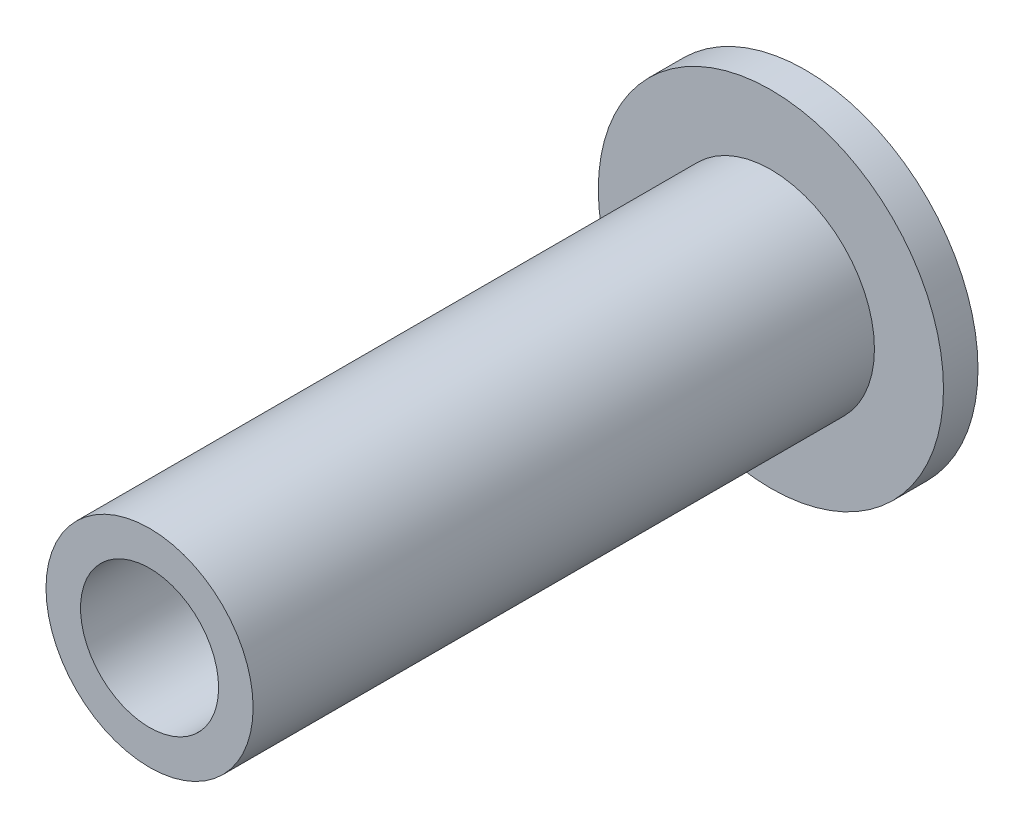
ISO-10303-21;
HEADER;
FILE_DESCRIPTION(('STEP AP214'),'2;1');
FILE_NAME('part.step','',(''),(''),'','','');
FILE_SCHEMA(('AUTOMOTIVE_DESIGN { 1 0 10303 214 1 1 1 1 }'));
ENDSEC;
DATA;
#1=APPLICATION_CONTEXT('core data for automotive mechanical design processes');
#2=APPLICATION_PROTOCOL_DEFINITION('international standard','automotive_design',2000,#1);
#3=PRODUCT_CONTEXT('',#1,'mechanical');
#4=PRODUCT('Part','Part','',(#3));
#5=PRODUCT_RELATED_PRODUCT_CATEGORY('part','',(#4));
#6=PRODUCT_DEFINITION_FORMATION('','',#4);
#7=PRODUCT_DEFINITION_CONTEXT('part definition',#1,'design');
#8=PRODUCT_DEFINITION('design','',#6,#7);
#9=PRODUCT_DEFINITION_SHAPE('','',#8);
#10=(LENGTH_UNIT() NAMED_UNIT(*) SI_UNIT(.MILLI.,.METRE.));
#11=(NAMED_UNIT(*) PLANE_ANGLE_UNIT() SI_UNIT($,.RADIAN.));
#12=(NAMED_UNIT(*) SI_UNIT($,.STERADIAN.) SOLID_ANGLE_UNIT());
#13=UNCERTAINTY_MEASURE_WITH_UNIT(LENGTH_MEASURE(1.E-05),#10,'distance_accuracy_value','');
#14=(GEOMETRIC_REPRESENTATION_CONTEXT(3) GLOBAL_UNCERTAINTY_ASSIGNED_CONTEXT((#13)) GLOBAL_UNIT_ASSIGNED_CONTEXT((#10,
#11,#12)) REPRESENTATION_CONTEXT('',''));
#15=CARTESIAN_POINT('',(0.,0.,0.));
#16=DIRECTION('',(0.,0.,1.));
#17=DIRECTION('',(1.,0.,0.));
#18=AXIS2_PLACEMENT_3D('',#15,#16,#17);
#19=CARTESIAN_POINT('',(0.,3.,18.));
#20=DIRECTION('',(0.,0.,-1.));
#21=DIRECTION('',(-1.,0.,0.));
#22=AXIS2_PLACEMENT_3D('',#19,#20,#21);
#23=PLANE('',#22);
#24=CARTESIAN_POINT('',(0.,0.,18.));
#25=DIRECTION('',(0.,0.,1.));
#26=DIRECTION('',(1.,0.,0.));
#27=AXIS2_PLACEMENT_3D('',#24,#25,#26);
#28=CIRCLE('',#27,2.);
#29=CARTESIAN_POINT('',(2.,0.,18.));
#30=VERTEX_POINT('',#29);
#31=EDGE_CURVE('E11',#30,#30,#28,.T.);
#32=ORIENTED_EDGE('',*,*,#31,.F.);
#33=EDGE_LOOP('',(#32));
#34=FACE_BOUND('',#33,.T.);
#35=CARTESIAN_POINT('',(0.,0.,18.));
#36=DIRECTION('',(0.,0.,1.));
#37=DIRECTION('',(1.,0.,0.));
#38=AXIS2_PLACEMENT_3D('',#35,#36,#37);
#39=CIRCLE('',#38,3.);
#40=CARTESIAN_POINT('',(3.,0.,18.));
#41=VERTEX_POINT('',#40);
#42=EDGE_CURVE('E60',#41,#41,#39,.T.);
#43=ORIENTED_EDGE('',*,*,#42,.T.);
#44=EDGE_LOOP('',(#43));
#45=FACE_BOUND('',#44,.T.);
#46=ADVANCED_FACE('F32',(#34,#45),#23,.F.);
#47=CARTESIAN_POINT('',(0.,0.,27.6551724137931));
#48=DIRECTION('',(0.,0.,1.));
#49=DIRECTION('',(1.,0.,0.));
#50=AXIS2_PLACEMENT_3D('',#47,#48,#49);
#51=CYLINDRICAL_SURFACE('',#50,2.);
#52=CARTESIAN_POINT('',(0.,0.,1.15470053837925));
#53=DIRECTION('',(0.,0.,1.));
#54=DIRECTION('',(1.,0.,0.));
#55=AXIS2_PLACEMENT_3D('',#52,#53,#54);
#56=CIRCLE('',#55,2.);
#57=CARTESIAN_POINT('',(2.,0.,1.15470053837925));
#58=VERTEX_POINT('',#57);
#59=EDGE_CURVE('E38',#58,#58,#56,.T.);
#60=ORIENTED_EDGE('',*,*,#59,.F.);
#61=EDGE_LOOP('',(#60));
#62=FACE_BOUND('',#61,.T.);
#63=ORIENTED_EDGE('',*,*,#31,.T.);
#64=EDGE_LOOP('',(#63));
#65=FACE_BOUND('',#64,.T.);
#66=ADVANCED_FACE('F45',(#62,#65),#51,.F.);
#67=CARTESIAN_POINT('',(0.,0.,1.15470053837925));
#68=DIRECTION('',(0.,0.,1.));
#69=DIRECTION('',(1.,0.,0.));
#70=AXIS2_PLACEMENT_3D('',#67,#68,#69);
#71=CONICAL_SURFACE('',#70,2.,1.0471975511966);
#72=CARTESIAN_POINT('',(0.,0.,0.));
#73=VERTEX_POINT('',#72);
#74=VERTEX_LOOP('',#73);
#75=FACE_BOUND('',#74,.T.);
#76=ORIENTED_EDGE('',*,*,#59,.T.);
#77=EDGE_LOOP('',(#76));
#78=FACE_BOUND('',#77,.T.);
#79=ADVANCED_FACE('F41',(#75,#78),#71,.F.);
#80=CARTESIAN_POINT('',(0.,0.,25.));
#81=DIRECTION('',(0.,0.,1.));
#82=DIRECTION('',(0.,1.,0.));
#83=AXIS2_PLACEMENT_3D('',#80,#81,#82);
#84=SPHERICAL_SURFACE('',#83,26.4764045897475);
#85=CARTESIAN_POINT('',(0.,0.,-1.));
#86=DIRECTION('',(0.,0.,1.));
#87=DIRECTION('',(1.,0.,0.));
#88=AXIS2_PLACEMENT_3D('',#85,#86,#87);
#89=CIRCLE('',#88,5.);
#90=CARTESIAN_POINT('',(5.,0.,-1.));
#91=VERTEX_POINT('',#90);
#92=EDGE_CURVE('E50',#91,#91,#89,.T.);
#93=ORIENTED_EDGE('',*,*,#92,.F.);
#94=EDGE_LOOP('',(#93));
#95=FACE_BOUND('',#94,.T.);
#96=ADVANCED_FACE('F44',(#95),#84,.T.);
#97=CARTESIAN_POINT('',(0.,0.,27.6551724137931));
#98=DIRECTION('',(0.,0.,1.));
#99=DIRECTION('',(1.,0.,0.));
#100=AXIS2_PLACEMENT_3D('',#97,#98,#99);
#101=CYLINDRICAL_SURFACE('',#100,5.);
#102=CARTESIAN_POINT('',(0.,0.,0.));
#103=DIRECTION('',(0.,0.,1.));
#104=DIRECTION('',(1.,0.,0.));
#105=AXIS2_PLACEMENT_3D('',#102,#103,#104);
#106=CIRCLE('',#105,5.);
#107=CARTESIAN_POINT('',(5.,0.,0.));
#108=VERTEX_POINT('',#107);
#109=EDGE_CURVE('E52',#108,#108,#106,.T.);
#110=ORIENTED_EDGE('',*,*,#109,.F.);
#111=EDGE_LOOP('',(#110));
#112=FACE_BOUND('',#111,.T.);
#113=ORIENTED_EDGE('',*,*,#92,.T.);
#114=EDGE_LOOP('',(#113));
#115=FACE_BOUND('',#114,.T.);
#116=ADVANCED_FACE('F74',(#112,#115),#101,.T.);
#117=CARTESIAN_POINT('',(0.,3.,0.));
#118=DIRECTION('',(0.,0.,-1.));
#119=DIRECTION('',(-1.,0.,0.));
#120=AXIS2_PLACEMENT_3D('',#117,#118,#119);
#121=PLANE('',#120);
#122=CARTESIAN_POINT('',(0.,0.,0.));
#123=DIRECTION('',(0.,0.,1.));
#124=DIRECTION('',(1.,0.,0.));
#125=AXIS2_PLACEMENT_3D('',#122,#123,#124);
#126=CIRCLE('',#125,3.);
#127=CARTESIAN_POINT('',(3.,0.,0.));
#128=VERTEX_POINT('',#127);
#129=EDGE_CURVE('E57',#128,#128,#126,.T.);
#130=ORIENTED_EDGE('',*,*,#129,.F.);
#131=EDGE_LOOP('',(#130));
#132=FACE_BOUND('',#131,.T.);
#133=ORIENTED_EDGE('',*,*,#109,.T.);
#134=EDGE_LOOP('',(#133));
#135=FACE_BOUND('',#134,.T.);
#136=ADVANCED_FACE('F68',(#132,#135),#121,.F.);
#137=CARTESIAN_POINT('',(0.,0.,27.6551724137931));
#138=DIRECTION('',(0.,0.,1.));
#139=DIRECTION('',(1.,0.,0.));
#140=AXIS2_PLACEMENT_3D('',#137,#138,#139);
#141=CYLINDRICAL_SURFACE('',#140,3.);
#142=ORIENTED_EDGE('',*,*,#42,.F.);
#143=EDGE_LOOP('',(#142));
#144=FACE_BOUND('',#143,.T.);
#145=ORIENTED_EDGE('',*,*,#129,.T.);
#146=EDGE_LOOP('',(#145));
#147=FACE_BOUND('',#146,.T.);
#148=ADVANCED_FACE('F65',(#144,#147),#141,.T.);
#149=CLOSED_SHELL('',(#46,#66,#79,#96,#116,#136,#148));
#150=MANIFOLD_SOLID_BREP('B2',#149);
#151=ADVANCED_BREP_SHAPE_REPRESENTATION('',(#18,#150),#14);
#152=SHAPE_DEFINITION_REPRESENTATION(#9,#151);
ENDSEC;
END-ISO-10303-21;
